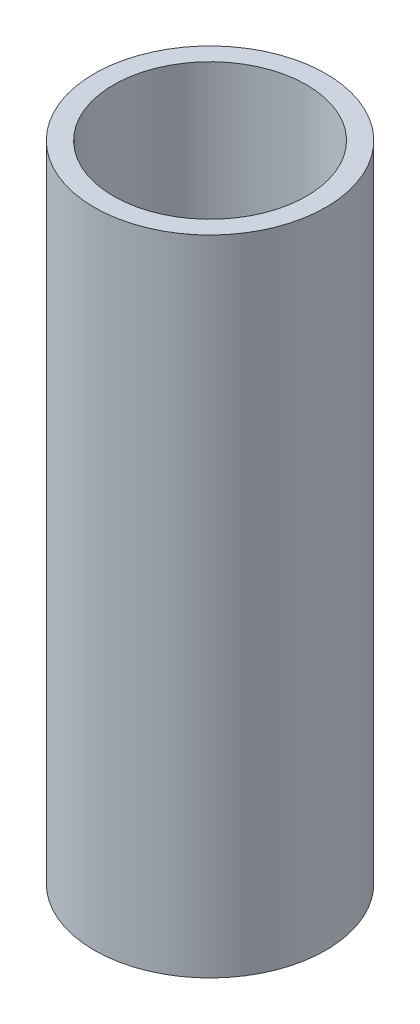
ISO-10303-21;
HEADER;
FILE_DESCRIPTION(('STEP AP214'),'2;1');
FILE_NAME('part.step','',(''),(''),'','','');
FILE_SCHEMA(('AUTOMOTIVE_DESIGN { 1 0 10303 214 1 1 1 1 }'));
ENDSEC;
DATA;
#1=APPLICATION_CONTEXT('core data for automotive mechanical design processes');
#2=APPLICATION_PROTOCOL_DEFINITION('international standard','automotive_design',2000,#1);
#3=PRODUCT_CONTEXT('',#1,'mechanical');
#4=PRODUCT('Part','Part','',(#3));
#5=PRODUCT_RELATED_PRODUCT_CATEGORY('part','',(#4));
#6=PRODUCT_DEFINITION_FORMATION('','',#4);
#7=PRODUCT_DEFINITION_CONTEXT('part definition',#1,'design');
#8=PRODUCT_DEFINITION('design','',#6,#7);
#9=PRODUCT_DEFINITION_SHAPE('','',#8);
#10=(LENGTH_UNIT() NAMED_UNIT(*) SI_UNIT(.MILLI.,.METRE.));
#11=(NAMED_UNIT(*) PLANE_ANGLE_UNIT() SI_UNIT($,.RADIAN.));
#12=(NAMED_UNIT(*) SI_UNIT($,.STERADIAN.) SOLID_ANGLE_UNIT());
#13=UNCERTAINTY_MEASURE_WITH_UNIT(LENGTH_MEASURE(1.E-05),#10,'distance_accuracy_value','');
#14=(GEOMETRIC_REPRESENTATION_CONTEXT(3) GLOBAL_UNCERTAINTY_ASSIGNED_CONTEXT((#13)) GLOBAL_UNIT_ASSIGNED_CONTEXT((#10,
#11,#12)) REPRESENTATION_CONTEXT('',''));
#15=CARTESIAN_POINT('',(0.,0.,0.));
#16=DIRECTION('',(0.,0.,1.));
#17=DIRECTION('',(1.,0.,0.));
#18=AXIS2_PLACEMENT_3D('',#15,#16,#17);
#19=CARTESIAN_POINT('',(0.,100.,0.));
#20=DIRECTION('',(0.,1.,0.));
#21=DIRECTION('',(0.,0.,1.));
#22=AXIS2_PLACEMENT_3D('',#19,#20,#21);
#23=PLANE('',#22);
#24=CARTESIAN_POINT('',(0.,100.,0.));
#25=DIRECTION('',(0.,1.,0.));
#26=DIRECTION('',(0.,0.,1.));
#27=AXIS2_PLACEMENT_3D('',#24,#25,#26);
#28=CIRCLE('',#27,18.);
#29=CARTESIAN_POINT('',(0.,100.,18.));
#30=VERTEX_POINT('',#29);
#31=EDGE_CURVE('E10',#30,#30,#28,.T.);
#32=ORIENTED_EDGE('',*,*,#31,.T.);
#33=EDGE_LOOP('',(#32));
#34=FACE_BOUND('',#33,.T.);
#35=CARTESIAN_POINT('',(0.,100.,0.));
#36=DIRECTION('',(0.,1.,0.));
#37=DIRECTION('',(0.,0.,1.));
#38=AXIS2_PLACEMENT_3D('',#35,#36,#37);
#39=CIRCLE('',#38,15.);
#40=CARTESIAN_POINT('',(0.,100.,15.));
#41=VERTEX_POINT('',#40);
#42=EDGE_CURVE('E42',#41,#41,#39,.T.);
#43=ORIENTED_EDGE('',*,*,#42,.F.);
#44=EDGE_LOOP('',(#43));
#45=FACE_BOUND('',#44,.T.);
#46=ADVANCED_FACE('F31',(#34,#45),#23,.T.);
#47=CARTESIAN_POINT('',(0.,0.,0.));
#48=DIRECTION('',(0.,1.,0.));
#49=DIRECTION('',(0.,0.,1.));
#50=AXIS2_PLACEMENT_3D('',#47,#48,#49);
#51=PLANE('',#50);
#52=CARTESIAN_POINT('',(0.,0.,0.));
#53=DIRECTION('',(0.,1.,0.));
#54=DIRECTION('',(0.,0.,1.));
#55=AXIS2_PLACEMENT_3D('',#52,#53,#54);
#56=CIRCLE('',#55,18.);
#57=CARTESIAN_POINT('',(0.,0.,18.));
#58=VERTEX_POINT('',#57);
#59=EDGE_CURVE('E35',#58,#58,#56,.T.);
#60=ORIENTED_EDGE('',*,*,#59,.F.);
#61=EDGE_LOOP('',(#60));
#62=FACE_BOUND('',#61,.T.);
#63=CARTESIAN_POINT('',(0.,0.,0.));
#64=DIRECTION('',(0.,1.,0.));
#65=DIRECTION('',(0.,0.,1.));
#66=AXIS2_PLACEMENT_3D('',#63,#64,#65);
#67=CIRCLE('',#66,15.);
#68=CARTESIAN_POINT('',(0.,0.,15.));
#69=VERTEX_POINT('',#68);
#70=EDGE_CURVE('E44',#69,#69,#67,.T.);
#71=ORIENTED_EDGE('',*,*,#70,.T.);
#72=EDGE_LOOP('',(#71));
#73=FACE_BOUND('',#72,.T.);
#74=ADVANCED_FACE('F54',(#62,#73),#51,.F.);
#75=CARTESIAN_POINT('',(0.,100.,0.));
#76=DIRECTION('',(0.,-1.,0.));
#77=DIRECTION('',(0.,0.,-1.));
#78=AXIS2_PLACEMENT_3D('',#75,#76,#77);
#79=CYLINDRICAL_SURFACE('',#78,18.);
#80=ORIENTED_EDGE('',*,*,#31,.F.);
#81=EDGE_LOOP('',(#80));
#82=FACE_BOUND('',#81,.T.);
#83=ORIENTED_EDGE('',*,*,#59,.T.);
#84=EDGE_LOOP('',(#83));
#85=FACE_BOUND('',#84,.T.);
#86=ADVANCED_FACE('F33',(#82,#85),#79,.T.);
#87=CARTESIAN_POINT('',(0.,100.,0.));
#88=DIRECTION('',(0.,-1.,0.));
#89=DIRECTION('',(0.,0.,-1.));
#90=AXIS2_PLACEMENT_3D('',#87,#88,#89);
#91=CYLINDRICAL_SURFACE('',#90,15.);
#92=ORIENTED_EDGE('',*,*,#42,.T.);
#93=EDGE_LOOP('',(#92));
#94=FACE_BOUND('',#93,.T.);
#95=ORIENTED_EDGE('',*,*,#70,.F.);
#96=EDGE_LOOP('',(#95));
#97=FACE_BOUND('',#96,.T.);
#98=ADVANCED_FACE('F50',(#94,#97),#91,.F.);
#99=CLOSED_SHELL('',(#46,#74,#86,#98));
#100=MANIFOLD_SOLID_BREP('B2',#99);
#101=ADVANCED_BREP_SHAPE_REPRESENTATION('',(#18,#100),#14);
#102=SHAPE_DEFINITION_REPRESENTATION(#9,#101);
ENDSEC;
END-ISO-10303-21;
